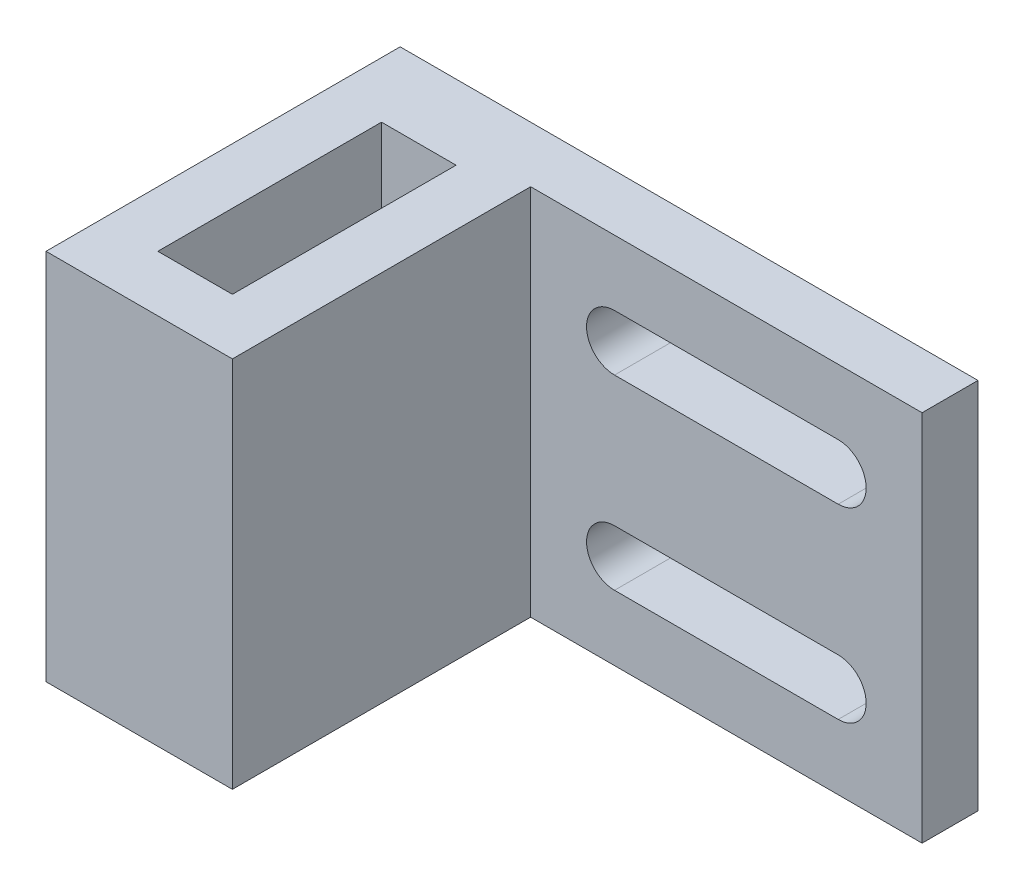
ISO-10303-21;
HEADER;
FILE_DESCRIPTION(('STEP AP214'),'2;1');
FILE_NAME('part.step','',(''),(''),'','','');
FILE_SCHEMA(('AUTOMOTIVE_DESIGN { 1 0 10303 214 1 1 1 1 }'));
ENDSEC;
DATA;
#1=APPLICATION_CONTEXT('core data for automotive mechanical design processes');
#2=APPLICATION_PROTOCOL_DEFINITION('international standard','automotive_design',2000,#1);
#3=PRODUCT_CONTEXT('',#1,'mechanical');
#4=PRODUCT('Part','Part','',(#3));
#5=PRODUCT_RELATED_PRODUCT_CATEGORY('part','',(#4));
#6=PRODUCT_DEFINITION_FORMATION('','',#4);
#7=PRODUCT_DEFINITION_CONTEXT('part definition',#1,'design');
#8=PRODUCT_DEFINITION('design','',#6,#7);
#9=PRODUCT_DEFINITION_SHAPE('','',#8);
#10=(LENGTH_UNIT() NAMED_UNIT(*) SI_UNIT(.MILLI.,.METRE.));
#11=(NAMED_UNIT(*) PLANE_ANGLE_UNIT() SI_UNIT($,.RADIAN.));
#12=(NAMED_UNIT(*) SI_UNIT($,.STERADIAN.) SOLID_ANGLE_UNIT());
#13=UNCERTAINTY_MEASURE_WITH_UNIT(LENGTH_MEASURE(1.E-05),#10,'distance_accuracy_value','');
#14=(GEOMETRIC_REPRESENTATION_CONTEXT(3) GLOBAL_UNCERTAINTY_ASSIGNED_CONTEXT((#13)) GLOBAL_UNIT_ASSIGNED_CONTEXT((#10,
#11,#12)) REPRESENTATION_CONTEXT('',''));
#15=CARTESIAN_POINT('',(0.,0.,0.));
#16=DIRECTION('',(0.,0.,1.));
#17=DIRECTION('',(1.,0.,0.));
#18=AXIS2_PLACEMENT_3D('',#15,#16,#17);
#19=CARTESIAN_POINT('',(2.,20.,-3.));
#20=DIRECTION('',(1.,0.,0.));
#21=DIRECTION('',(0.,0.,-1.));
#22=AXIS2_PLACEMENT_3D('',#19,#20,#21);
#23=PLANE('',#22);
#24=DIRECTION('',(0.,1.,0.));
#25=VECTOR('',#24,1.);
#26=CARTESIAN_POINT('',(2.,20.,-15.));
#27=LINE('',#26,#25);
#28=CARTESIAN_POINT('',(2.,0.,-15.));
#29=VERTEX_POINT('',#28);
#30=CARTESIAN_POINT('',(2.,20.,-15.));
#31=VERTEX_POINT('',#30);
#32=EDGE_CURVE('E170',#29,#31,#27,.T.);
#33=ORIENTED_EDGE('',*,*,#32,.F.);
#34=DIRECTION('',(0.,0.,1.));
#35=VECTOR('',#34,1.);
#36=CARTESIAN_POINT('',(2.,0.,-3.));
#37=LINE('',#36,#35);
#38=CARTESIAN_POINT('',(2.,0.,-3.));
#39=VERTEX_POINT('',#38);
#40=EDGE_CURVE('E160',#29,#39,#37,.T.);
#41=ORIENTED_EDGE('',*,*,#40,.T.);
#42=DIRECTION('',(0.,-1.,0.));
#43=VECTOR('',#42,1.);
#44=CARTESIAN_POINT('',(2.,20.,-3.));
#45=LINE('',#44,#43);
#46=CARTESIAN_POINT('',(2.,20.,-3.));
#47=VERTEX_POINT('',#46);
#48=EDGE_CURVE('E261',#47,#39,#45,.T.);
#49=ORIENTED_EDGE('',*,*,#48,.F.);
#50=DIRECTION('',(0.,0.,1.));
#51=VECTOR('',#50,1.);
#52=CARTESIAN_POINT('',(2.,20.,-3.));
#53=LINE('',#52,#51);
#54=EDGE_CURVE('E56',#31,#47,#53,.T.);
#55=ORIENTED_EDGE('',*,*,#54,.F.);
#56=EDGE_LOOP('',(#33,#41,#49,#55));
#57=FACE_BOUND('',#56,.T.);
#58=ADVANCED_FACE('F33',(#57),#23,.F.);
#59=CARTESIAN_POINT('',(-2.,20.,-19.));
#60=DIRECTION('',(-1.,0.,0.));
#61=DIRECTION('',(0.,0.,1.));
#62=AXIS2_PLACEMENT_3D('',#59,#60,#61);
#63=PLANE('',#62);
#64=DIRECTION('',(0.,-1.,0.));
#65=VECTOR('',#64,1.);
#66=CARTESIAN_POINT('',(-2.,20.,-15.));
#67=LINE('',#66,#65);
#68=CARTESIAN_POINT('',(-2.,20.,-15.));
#69=VERTEX_POINT('',#68);
#70=CARTESIAN_POINT('',(-2.,0.,-15.));
#71=VERTEX_POINT('',#70);
#72=EDGE_CURVE('E48',#69,#71,#67,.T.);
#73=ORIENTED_EDGE('',*,*,#72,.F.);
#74=DIRECTION('',(0.,0.,-1.));
#75=VECTOR('',#74,1.);
#76=CARTESIAN_POINT('',(-2.,20.,-19.));
#77=LINE('',#76,#75);
#78=CARTESIAN_POINT('',(-2.,20.,-3.));
#79=VERTEX_POINT('',#78);
#80=EDGE_CURVE('E239',#79,#69,#77,.T.);
#81=ORIENTED_EDGE('',*,*,#80,.F.);
#82=DIRECTION('',(0.,-1.,0.));
#83=VECTOR('',#82,1.);
#84=CARTESIAN_POINT('',(-2.,20.,-3.));
#85=LINE('',#84,#83);
#86=CARTESIAN_POINT('',(-2.,0.,-3.));
#87=VERTEX_POINT('',#86);
#88=EDGE_CURVE('E258',#79,#87,#85,.T.);
#89=ORIENTED_EDGE('',*,*,#88,.T.);
#90=DIRECTION('',(0.,0.,-1.));
#91=VECTOR('',#90,1.);
#92=CARTESIAN_POINT('',(-2.,0.,-19.));
#93=LINE('',#92,#91);
#94=EDGE_CURVE('E253',#87,#71,#93,.T.);
#95=ORIENTED_EDGE('',*,*,#94,.T.);
#96=EDGE_LOOP('',(#73,#81,#89,#95));
#97=FACE_BOUND('',#96,.T.);
#98=ADVANCED_FACE('F328',(#97),#63,.F.);
#99=CARTESIAN_POINT('',(-5.,20.,0.));
#100=DIRECTION('',(1.,0.,0.));
#101=DIRECTION('',(0.,0.,-1.));
#102=AXIS2_PLACEMENT_3D('',#99,#100,#101);
#103=PLANE('',#102);
#104=DIRECTION('',(0.,0.,1.));
#105=VECTOR('',#104,1.);
#106=CARTESIAN_POINT('',(-5.,0.,0.));
#107=LINE('',#106,#105);
#108=CARTESIAN_POINT('',(-5.,0.,-19.));
#109=VERTEX_POINT('',#108);
#110=CARTESIAN_POINT('',(-5.,0.,0.));
#111=VERTEX_POINT('',#110);
#112=EDGE_CURVE('E197',#109,#111,#107,.T.);
#113=ORIENTED_EDGE('',*,*,#112,.T.);
#114=DIRECTION('',(0.,-1.,0.));
#115=VECTOR('',#114,1.);
#116=CARTESIAN_POINT('',(-5.,20.,0.));
#117=LINE('',#116,#115);
#118=CARTESIAN_POINT('',(-5.,20.,0.));
#119=VERTEX_POINT('',#118);
#120=EDGE_CURVE('E275',#119,#111,#117,.T.);
#121=ORIENTED_EDGE('',*,*,#120,.F.);
#122=DIRECTION('',(0.,0.,1.));
#123=VECTOR('',#122,1.);
#124=CARTESIAN_POINT('',(-5.,20.,0.));
#125=LINE('',#124,#123);
#126=CARTESIAN_POINT('',(-5.,20.,-19.));
#127=VERTEX_POINT('',#126);
#128=EDGE_CURVE('E222',#127,#119,#125,.T.);
#129=ORIENTED_EDGE('',*,*,#128,.F.);
#130=DIRECTION('',(0.,-1.,0.));
#131=VECTOR('',#130,1.);
#132=CARTESIAN_POINT('',(-5.,20.,-19.));
#133=LINE('',#132,#131);
#134=EDGE_CURVE('E241',#127,#109,#133,.T.);
#135=ORIENTED_EDGE('',*,*,#134,.T.);
#136=EDGE_LOOP('',(#113,#121,#129,#135));
#137=FACE_BOUND('',#136,.T.);
#138=ADVANCED_FACE('F35',(#137),#103,.F.);
#139=CARTESIAN_POINT('',(5.,20.,0.));
#140=DIRECTION('',(0.,0.,-1.));
#141=DIRECTION('',(-1.,0.,0.));
#142=AXIS2_PLACEMENT_3D('',#139,#140,#141);
#143=PLANE('',#142);
#144=DIRECTION('',(1.,0.,0.));
#145=VECTOR('',#144,1.);
#146=CARTESIAN_POINT('',(5.,0.,0.));
#147=LINE('',#146,#145);
#148=CARTESIAN_POINT('',(5.,0.,0.));
#149=VERTEX_POINT('',#148);
#150=EDGE_CURVE('E244',#111,#149,#147,.T.);
#151=ORIENTED_EDGE('',*,*,#150,.T.);
#152=DIRECTION('',(0.,-1.,0.));
#153=VECTOR('',#152,1.);
#154=CARTESIAN_POINT('',(5.,20.,0.));
#155=LINE('',#154,#153);
#156=CARTESIAN_POINT('',(5.,20.,0.));
#157=VERTEX_POINT('',#156);
#158=EDGE_CURVE('E272',#157,#149,#155,.T.);
#159=ORIENTED_EDGE('',*,*,#158,.F.);
#160=DIRECTION('',(1.,0.,0.));
#161=VECTOR('',#160,1.);
#162=CARTESIAN_POINT('',(5.,20.,0.));
#163=LINE('',#162,#161);
#164=EDGE_CURVE('E225',#119,#157,#163,.T.);
#165=ORIENTED_EDGE('',*,*,#164,.F.);
#166=ORIENTED_EDGE('',*,*,#120,.T.);
#167=EDGE_LOOP('',(#151,#159,#165,#166));
#168=FACE_BOUND('',#167,.T.);
#169=ADVANCED_FACE('F345',(#168),#143,.F.);
#170=CARTESIAN_POINT('',(4.99999999999999,20.,-16.));
#171=DIRECTION('',(-1.,0.,0.));
#172=DIRECTION('',(0.,0.,1.));
#173=AXIS2_PLACEMENT_3D('',#170,#171,#172);
#174=PLANE('',#173);
#175=DIRECTION('',(0.,0.,-1.));
#176=VECTOR('',#175,1.);
#177=CARTESIAN_POINT('',(4.99999999999999,0.,-16.));
#178=LINE('',#177,#176);
#179=CARTESIAN_POINT('',(4.99999999999999,0.,-16.));
#180=VERTEX_POINT('',#179);
#181=EDGE_CURVE('E246',#149,#180,#178,.T.);
#182=ORIENTED_EDGE('',*,*,#181,.T.);
#183=DIRECTION('',(0.,-1.,0.));
#184=VECTOR('',#183,1.);
#185=CARTESIAN_POINT('',(4.99999999999999,20.,-16.));
#186=LINE('',#185,#184);
#187=CARTESIAN_POINT('',(4.99999999999999,20.,-16.));
#188=VERTEX_POINT('',#187);
#189=EDGE_CURVE('E269',#188,#180,#186,.T.);
#190=ORIENTED_EDGE('',*,*,#189,.F.);
#191=DIRECTION('',(0.,0.,-1.));
#192=VECTOR('',#191,1.);
#193=CARTESIAN_POINT('',(4.99999999999999,20.,-16.));
#194=LINE('',#193,#192);
#195=EDGE_CURVE('E228',#157,#188,#194,.T.);
#196=ORIENTED_EDGE('',*,*,#195,.F.);
#197=ORIENTED_EDGE('',*,*,#158,.T.);
#198=EDGE_LOOP('',(#182,#190,#196,#197));
#199=FACE_BOUND('',#198,.T.);
#200=ADVANCED_FACE('F343',(#199),#174,.F.);
#201=CARTESIAN_POINT('',(26.,20.,-16.));
#202=DIRECTION('',(0.,0.,-1.));
#203=DIRECTION('',(-1.,0.,0.));
#204=AXIS2_PLACEMENT_3D('',#201,#202,#203);
#205=PLANE('',#204);
#206=DIRECTION('',(-1.,0.,0.));
#207=VECTOR('',#206,1.);
#208=CARTESIAN_POINT('',(21.5,16.5,-16.));
#209=LINE('',#208,#207);
#210=CARTESIAN_POINT('',(21.5,16.5,-16.));
#211=VERTEX_POINT('',#210);
#212=CARTESIAN_POINT('',(9.5,16.5,-16.));
#213=VERTEX_POINT('',#212);
#214=EDGE_CURVE('E184',#211,#213,#209,.T.);
#215=ORIENTED_EDGE('',*,*,#214,.F.);
#216=CARTESIAN_POINT('',(21.5,15.,-16.));
#217=DIRECTION('',(0.,0.,1.));
#218=DIRECTION('',(1.,0.,0.));
#219=AXIS2_PLACEMENT_3D('',#216,#217,#218);
#220=CIRCLE('',#219,1.50000000000001);
#221=CARTESIAN_POINT('',(21.5,13.5,-16.));
#222=VERTEX_POINT('',#221);
#223=EDGE_CURVE('E182',#222,#211,#220,.T.);
#224=ORIENTED_EDGE('',*,*,#223,.F.);
#225=DIRECTION('',(1.,0.,0.));
#226=VECTOR('',#225,1.);
#227=CARTESIAN_POINT('',(21.5,13.5,-16.));
#228=LINE('',#227,#226);
#229=CARTESIAN_POINT('',(9.5,13.5,-16.));
#230=VERTEX_POINT('',#229);
#231=EDGE_CURVE('E191',#230,#222,#228,.T.);
#232=ORIENTED_EDGE('',*,*,#231,.F.);
#233=CARTESIAN_POINT('',(9.5,15.,-16.));
#234=DIRECTION('',(0.,0.,1.));
#235=DIRECTION('',(-1.,0.,0.));
#236=AXIS2_PLACEMENT_3D('',#233,#234,#235);
#237=CIRCLE('',#236,1.50000000000001);
#238=EDGE_CURVE('E188',#213,#230,#237,.T.);
#239=ORIENTED_EDGE('',*,*,#238,.F.);
#240=EDGE_LOOP('',(#215,#224,#232,#239));
#241=FACE_BOUND('',#240,.T.);
#242=DIRECTION('',(-1.,0.,0.));
#243=VECTOR('',#242,1.);
#244=CARTESIAN_POINT('',(21.5,6.50000000000001,-16.));
#245=LINE('',#244,#243);
#246=CARTESIAN_POINT('',(21.5,6.50000000000001,-16.));
#247=VERTEX_POINT('',#246);
#248=CARTESIAN_POINT('',(9.5,6.50000000000001,-16.));
#249=VERTEX_POINT('',#248);
#250=EDGE_CURVE('E205',#247,#249,#245,.T.);
#251=ORIENTED_EDGE('',*,*,#250,.F.);
#252=CARTESIAN_POINT('',(21.5,5.,-16.));
#253=DIRECTION('',(0.,0.,1.));
#254=DIRECTION('',(-1.,0.,0.));
#255=AXIS2_PLACEMENT_3D('',#252,#253,#254);
#256=CIRCLE('',#255,1.50000000000001);
#257=CARTESIAN_POINT('',(21.5,3.5,-16.));
#258=VERTEX_POINT('',#257);
#259=EDGE_CURVE('E174',#258,#247,#256,.T.);
#260=ORIENTED_EDGE('',*,*,#259,.F.);
#261=DIRECTION('',(1.,0.,0.));
#262=VECTOR('',#261,1.);
#263=CARTESIAN_POINT('',(21.5,3.5,-16.));
#264=LINE('',#263,#262);
#265=CARTESIAN_POINT('',(9.5,3.49999999999999,-16.));
#266=VERTEX_POINT('',#265);
#267=EDGE_CURVE('E211',#266,#258,#264,.T.);
#268=ORIENTED_EDGE('',*,*,#267,.F.);
#269=CARTESIAN_POINT('',(9.5,5.,-16.));
#270=DIRECTION('',(0.,0.,1.));
#271=DIRECTION('',(1.,0.,0.));
#272=AXIS2_PLACEMENT_3D('',#269,#270,#271);
#273=CIRCLE('',#272,1.50000000000001);
#274=EDGE_CURVE('E208',#249,#266,#273,.T.);
#275=ORIENTED_EDGE('',*,*,#274,.F.);
#276=EDGE_LOOP('',(#251,#260,#268,#275));
#277=FACE_BOUND('',#276,.T.);
#278=DIRECTION('',(1.,0.,0.));
#279=VECTOR('',#278,1.);
#280=CARTESIAN_POINT('',(26.,0.,-16.));
#281=LINE('',#280,#279);
#282=CARTESIAN_POINT('',(26.,0.,-16.));
#283=VERTEX_POINT('',#282);
#284=EDGE_CURVE('E248',#180,#283,#281,.T.);
#285=ORIENTED_EDGE('',*,*,#284,.T.);
#286=DIRECTION('',(0.,-1.,0.));
#287=VECTOR('',#286,1.);
#288=CARTESIAN_POINT('',(26.,20.,-16.));
#289=LINE('',#288,#287);
#290=CARTESIAN_POINT('',(26.,20.,-16.));
#291=VERTEX_POINT('',#290);
#292=EDGE_CURVE('E266',#291,#283,#289,.T.);
#293=ORIENTED_EDGE('',*,*,#292,.F.);
#294=DIRECTION('',(1.,0.,0.));
#295=VECTOR('',#294,1.);
#296=CARTESIAN_POINT('',(26.,20.,-16.));
#297=LINE('',#296,#295);
#298=EDGE_CURVE('E230',#188,#291,#297,.T.);
#299=ORIENTED_EDGE('',*,*,#298,.F.);
#300=ORIENTED_EDGE('',*,*,#189,.T.);
#301=EDGE_LOOP('',(#285,#293,#299,#300));
#302=FACE_BOUND('',#301,.T.);
#303=ADVANCED_FACE('F311',(#241,#277,#302),#205,.F.);
#304=CARTESIAN_POINT('',(26.,20.,-19.));
#305=DIRECTION('',(-1.,0.,0.));
#306=DIRECTION('',(0.,0.,1.));
#307=AXIS2_PLACEMENT_3D('',#304,#305,#306);
#308=PLANE('',#307);
#309=DIRECTION('',(0.,0.,-1.));
#310=VECTOR('',#309,1.);
#311=CARTESIAN_POINT('',(26.,0.,-19.));
#312=LINE('',#311,#310);
#313=CARTESIAN_POINT('',(26.,0.,-19.));
#314=VERTEX_POINT('',#313);
#315=EDGE_CURVE('E168',#283,#314,#312,.T.);
#316=ORIENTED_EDGE('',*,*,#315,.T.);
#317=DIRECTION('',(0.,-1.,0.));
#318=VECTOR('',#317,1.);
#319=CARTESIAN_POINT('',(26.,20.,-19.));
#320=LINE('',#319,#318);
#321=CARTESIAN_POINT('',(26.,20.,-19.));
#322=VERTEX_POINT('',#321);
#323=EDGE_CURVE('E263',#322,#314,#320,.T.);
#324=ORIENTED_EDGE('',*,*,#323,.F.);
#325=DIRECTION('',(0.,0.,-1.));
#326=VECTOR('',#325,1.);
#327=CARTESIAN_POINT('',(26.,20.,-19.));
#328=LINE('',#327,#326);
#329=EDGE_CURVE('E232',#291,#322,#328,.T.);
#330=ORIENTED_EDGE('',*,*,#329,.F.);
#331=ORIENTED_EDGE('',*,*,#292,.T.);
#332=EDGE_LOOP('',(#316,#324,#330,#331));
#333=FACE_BOUND('',#332,.T.);
#334=ADVANCED_FACE('F337',(#333),#308,.F.);
#335=CARTESIAN_POINT('',(-2.,20.,-3.));
#336=DIRECTION('',(0.,0.,1.));
#337=DIRECTION('',(1.,0.,0.));
#338=AXIS2_PLACEMENT_3D('',#335,#336,#337);
#339=PLANE('',#338);
#340=DIRECTION('',(-1.,0.,0.));
#341=VECTOR('',#340,1.);
#342=CARTESIAN_POINT('',(-2.,0.,-3.));
#343=LINE('',#342,#341);
#344=EDGE_CURVE('E166',#39,#87,#343,.T.);
#345=ORIENTED_EDGE('',*,*,#344,.T.);
#346=ORIENTED_EDGE('',*,*,#88,.F.);
#347=DIRECTION('',(-1.,0.,0.));
#348=VECTOR('',#347,1.);
#349=CARTESIAN_POINT('',(-2.,20.,-3.));
#350=LINE('',#349,#348);
#351=EDGE_CURVE('E237',#47,#79,#350,.T.);
#352=ORIENTED_EDGE('',*,*,#351,.F.);
#353=ORIENTED_EDGE('',*,*,#48,.T.);
#354=EDGE_LOOP('',(#345,#346,#352,#353));
#355=FACE_BOUND('',#354,.T.);
#356=ADVANCED_FACE('F336',(#355),#339,.F.);
#357=CARTESIAN_POINT('',(-5.,20.,-19.));
#358=DIRECTION('',(0.,0.,1.));
#359=DIRECTION('',(1.,0.,0.));
#360=AXIS2_PLACEMENT_3D('',#357,#358,#359);
#361=PLANE('',#360);
#362=DIRECTION('',(-1.,0.,0.));
#363=VECTOR('',#362,1.);
#364=CARTESIAN_POINT('',(-5.,0.,-19.));
#365=LINE('',#364,#363);
#366=EDGE_CURVE('E226',#314,#109,#365,.T.);
#367=ORIENTED_EDGE('',*,*,#366,.T.);
#368=ORIENTED_EDGE('',*,*,#134,.F.);
#369=DIRECTION('',(-1.,0.,0.));
#370=VECTOR('',#369,1.);
#371=CARTESIAN_POINT('',(2.,20.,-19.));
#372=LINE('',#371,#370);
#373=EDGE_CURVE('E234',#322,#127,#372,.T.);
#374=ORIENTED_EDGE('',*,*,#373,.F.);
#375=ORIENTED_EDGE('',*,*,#323,.T.);
#376=EDGE_LOOP('',(#367,#368,#374,#375));
#377=FACE_BOUND('',#376,.T.);
#378=DIRECTION('',(1.,0.,0.));
#379=VECTOR('',#378,1.);
#380=CARTESIAN_POINT('',(2.,13.5,-19.));
#381=LINE('',#380,#379);
#382=CARTESIAN_POINT('',(9.5,13.5,-19.));
#383=VERTEX_POINT('',#382);
#384=CARTESIAN_POINT('',(21.5,13.5,-19.));
#385=VERTEX_POINT('',#384);
#386=EDGE_CURVE('E41',#383,#385,#381,.T.);
#387=ORIENTED_EDGE('',*,*,#386,.T.);
#388=CARTESIAN_POINT('',(21.5,15.,-19.));
#389=DIRECTION('',(0.,0.,1.));
#390=DIRECTION('',(1.,0.,0.));
#391=AXIS2_PLACEMENT_3D('',#388,#389,#390);
#392=CIRCLE('',#391,1.50000000000001);
#393=CARTESIAN_POINT('',(21.5,16.5,-19.));
#394=VERTEX_POINT('',#393);
#395=EDGE_CURVE('E11',#385,#394,#392,.T.);
#396=ORIENTED_EDGE('',*,*,#395,.T.);
#397=DIRECTION('',(-1.,0.,0.));
#398=VECTOR('',#397,1.);
#399=CARTESIAN_POINT('',(2.,16.5,-19.));
#400=LINE('',#399,#398);
#401=CARTESIAN_POINT('',(9.5,16.5,-19.));
#402=VERTEX_POINT('',#401);
#403=EDGE_CURVE('E290',#394,#402,#400,.T.);
#404=ORIENTED_EDGE('',*,*,#403,.T.);
#405=CARTESIAN_POINT('',(9.5,15.,-19.));
#406=DIRECTION('',(0.,0.,1.));
#407=DIRECTION('',(1.,0.,0.));
#408=AXIS2_PLACEMENT_3D('',#405,#406,#407);
#409=CIRCLE('',#408,1.50000000000001);
#410=EDGE_CURVE('E293',#402,#383,#409,.T.);
#411=ORIENTED_EDGE('',*,*,#410,.T.);
#412=EDGE_LOOP('',(#387,#396,#404,#411));
#413=FACE_BOUND('',#412,.T.);
#414=DIRECTION('',(1.,0.,0.));
#415=VECTOR('',#414,1.);
#416=CARTESIAN_POINT('',(2.,3.49999999999999,-19.));
#417=LINE('',#416,#415);
#418=CARTESIAN_POINT('',(9.5,3.49999999999999,-19.));
#419=VERTEX_POINT('',#418);
#420=CARTESIAN_POINT('',(21.5,3.5,-19.));
#421=VERTEX_POINT('',#420);
#422=EDGE_CURVE('E284',#419,#421,#417,.T.);
#423=ORIENTED_EDGE('',*,*,#422,.T.);
#424=CARTESIAN_POINT('',(21.5,5.,-19.));
#425=DIRECTION('',(0.,0.,1.));
#426=DIRECTION('',(1.,0.,0.));
#427=AXIS2_PLACEMENT_3D('',#424,#425,#426);
#428=CIRCLE('',#427,1.50000000000001);
#429=CARTESIAN_POINT('',(21.5,6.50000000000001,-19.));
#430=VERTEX_POINT('',#429);
#431=EDGE_CURVE('E287',#421,#430,#428,.T.);
#432=ORIENTED_EDGE('',*,*,#431,.T.);
#433=DIRECTION('',(-1.,0.,0.));
#434=VECTOR('',#433,1.);
#435=CARTESIAN_POINT('',(2.,6.50000000000001,-19.));
#436=LINE('',#435,#434);
#437=CARTESIAN_POINT('',(9.5,6.50000000000001,-19.));
#438=VERTEX_POINT('',#437);
#439=EDGE_CURVE('E278',#430,#438,#436,.T.);
#440=ORIENTED_EDGE('',*,*,#439,.T.);
#441=CARTESIAN_POINT('',(9.5,5.,-19.));
#442=DIRECTION('',(0.,0.,1.));
#443=DIRECTION('',(1.,0.,0.));
#444=AXIS2_PLACEMENT_3D('',#441,#442,#443);
#445=CIRCLE('',#444,1.50000000000001);
#446=EDGE_CURVE('E281',#438,#419,#445,.T.);
#447=ORIENTED_EDGE('',*,*,#446,.T.);
#448=EDGE_LOOP('',(#423,#432,#440,#447));
#449=FACE_BOUND('',#448,.T.);
#450=ADVANCED_FACE('F297',(#377,#413,#449),#361,.F.);
#451=CARTESIAN_POINT('',(0.,20.,0.));
#452=DIRECTION('',(0.,-1.,0.));
#453=DIRECTION('',(0.,0.,-1.));
#454=AXIS2_PLACEMENT_3D('',#451,#452,#453);
#455=PLANE('',#454);
#456=DIRECTION('',(-1.,0.,0.));
#457=VECTOR('',#456,1.);
#458=CARTESIAN_POINT('',(3.,20.,-15.));
#459=LINE('',#458,#457);
#460=EDGE_CURVE('E175',#31,#69,#459,.T.);
#461=ORIENTED_EDGE('',*,*,#460,.F.);
#462=ORIENTED_EDGE('',*,*,#54,.T.);
#463=ORIENTED_EDGE('',*,*,#351,.T.);
#464=ORIENTED_EDGE('',*,*,#80,.T.);
#465=EDGE_LOOP('',(#461,#462,#463,#464));
#466=FACE_BOUND('',#465,.T.);
#467=ORIENTED_EDGE('',*,*,#373,.T.);
#468=ORIENTED_EDGE('',*,*,#128,.T.);
#469=ORIENTED_EDGE('',*,*,#164,.T.);
#470=ORIENTED_EDGE('',*,*,#195,.T.);
#471=ORIENTED_EDGE('',*,*,#298,.T.);
#472=ORIENTED_EDGE('',*,*,#329,.T.);
#473=EDGE_LOOP('',(#467,#468,#469,#470,#471,#472));
#474=FACE_BOUND('',#473,.T.);
#475=ADVANCED_FACE('F368',(#466,#474),#455,.F.);
#476=CARTESIAN_POINT('',(0.,0.,0.));
#477=DIRECTION('',(0.,-1.,0.));
#478=DIRECTION('',(0.,0.,-1.));
#479=AXIS2_PLACEMENT_3D('',#476,#477,#478);
#480=PLANE('',#479);
#481=ORIENTED_EDGE('',*,*,#40,.F.);
#482=DIRECTION('',(-1.,0.,0.));
#483=VECTOR('',#482,1.);
#484=CARTESIAN_POINT('',(3.,0.,-15.));
#485=LINE('',#484,#483);
#486=EDGE_CURVE('E165',#29,#71,#485,.T.);
#487=ORIENTED_EDGE('',*,*,#486,.T.);
#488=ORIENTED_EDGE('',*,*,#94,.F.);
#489=ORIENTED_EDGE('',*,*,#344,.F.);
#490=EDGE_LOOP('',(#481,#487,#488,#489));
#491=FACE_BOUND('',#490,.T.);
#492=ORIENTED_EDGE('',*,*,#366,.F.);
#493=ORIENTED_EDGE('',*,*,#315,.F.);
#494=ORIENTED_EDGE('',*,*,#284,.F.);
#495=ORIENTED_EDGE('',*,*,#181,.F.);
#496=ORIENTED_EDGE('',*,*,#150,.F.);
#497=ORIENTED_EDGE('',*,*,#112,.F.);
#498=EDGE_LOOP('',(#492,#493,#494,#495,#496,#497));
#499=FACE_BOUND('',#498,.T.);
#500=ADVANCED_FACE('F161',(#491,#499),#480,.T.);
#501=CARTESIAN_POINT('',(21.5,5.,-36.));
#502=DIRECTION('',(0.,0.,1.));
#503=DIRECTION('',(1.,0.,0.));
#504=AXIS2_PLACEMENT_3D('',#501,#502,#503);
#505=CYLINDRICAL_SURFACE('',#504,1.50000000000001);
#506=DIRECTION('',(0.,0.,1.));
#507=VECTOR('',#506,1.);
#508=CARTESIAN_POINT('',(21.5,3.5,-36.));
#509=LINE('',#508,#507);
#510=EDGE_CURVE('E185',#421,#258,#509,.T.);
#511=ORIENTED_EDGE('',*,*,#510,.T.);
#512=ORIENTED_EDGE('',*,*,#259,.T.);
#513=DIRECTION('',(0.,0.,1.));
#514=VECTOR('',#513,1.);
#515=CARTESIAN_POINT('',(21.5,6.50000000000001,-36.));
#516=LINE('',#515,#514);
#517=EDGE_CURVE('E214',#430,#247,#516,.T.);
#518=ORIENTED_EDGE('',*,*,#517,.F.);
#519=ORIENTED_EDGE('',*,*,#431,.F.);
#520=EDGE_LOOP('',(#511,#512,#518,#519));
#521=FACE_BOUND('',#520,.T.);
#522=ADVANCED_FACE('F383',(#521),#505,.F.);
#523=CARTESIAN_POINT('',(21.5,3.5,-36.));
#524=DIRECTION('',(0.,-1.,0.));
#525=DIRECTION('',(1.,0.,0.));
#526=AXIS2_PLACEMENT_3D('',#523,#524,#525);
#527=PLANE('',#526);
#528=DIRECTION('',(0.,0.,1.));
#529=VECTOR('',#528,1.);
#530=CARTESIAN_POINT('',(9.5,3.49999999999999,-36.));
#531=LINE('',#530,#529);
#532=EDGE_CURVE('E216',#419,#266,#531,.T.);
#533=ORIENTED_EDGE('',*,*,#532,.T.);
#534=ORIENTED_EDGE('',*,*,#267,.T.);
#535=ORIENTED_EDGE('',*,*,#510,.F.);
#536=ORIENTED_EDGE('',*,*,#422,.F.);
#537=EDGE_LOOP('',(#533,#534,#535,#536));
#538=FACE_BOUND('',#537,.T.);
#539=ADVANCED_FACE('F387',(#538),#527,.F.);
#540=CARTESIAN_POINT('',(9.5,5.,-36.));
#541=DIRECTION('',(0.,0.,1.));
#542=DIRECTION('',(1.,0.,0.));
#543=AXIS2_PLACEMENT_3D('',#540,#541,#542);
#544=CYLINDRICAL_SURFACE('',#543,1.50000000000001);
#545=DIRECTION('',(0.,0.,1.));
#546=VECTOR('',#545,1.);
#547=CARTESIAN_POINT('',(9.5,6.50000000000001,-36.));
#548=LINE('',#547,#546);
#549=EDGE_CURVE('E218',#438,#249,#548,.T.);
#550=ORIENTED_EDGE('',*,*,#549,.T.);
#551=ORIENTED_EDGE('',*,*,#274,.T.);
#552=ORIENTED_EDGE('',*,*,#532,.F.);
#553=ORIENTED_EDGE('',*,*,#446,.F.);
#554=EDGE_LOOP('',(#550,#551,#552,#553));
#555=FACE_BOUND('',#554,.T.);
#556=ADVANCED_FACE('F392',(#555),#544,.F.);
#557=CARTESIAN_POINT('',(21.5,6.50000000000001,-36.));
#558=DIRECTION('',(0.,1.,0.));
#559=DIRECTION('',(-1.,0.,0.));
#560=AXIS2_PLACEMENT_3D('',#557,#558,#559);
#561=PLANE('',#560);
#562=ORIENTED_EDGE('',*,*,#517,.T.);
#563=ORIENTED_EDGE('',*,*,#250,.T.);
#564=ORIENTED_EDGE('',*,*,#549,.F.);
#565=ORIENTED_EDGE('',*,*,#439,.F.);
#566=EDGE_LOOP('',(#562,#563,#564,#565));
#567=FACE_BOUND('',#566,.T.);
#568=ADVANCED_FACE('F389',(#567),#561,.F.);
#569=CARTESIAN_POINT('',(21.5,15.,-36.));
#570=DIRECTION('',(0.,0.,1.));
#571=DIRECTION('',(1.,0.,0.));
#572=AXIS2_PLACEMENT_3D('',#569,#570,#571);
#573=CYLINDRICAL_SURFACE('',#572,1.50000000000001);
#574=DIRECTION('',(0.,0.,1.));
#575=VECTOR('',#574,1.);
#576=CARTESIAN_POINT('',(21.5,13.5,-36.));
#577=LINE('',#576,#575);
#578=EDGE_CURVE('E195',#385,#222,#577,.T.);
#579=ORIENTED_EDGE('',*,*,#578,.T.);
#580=ORIENTED_EDGE('',*,*,#223,.T.);
#581=DIRECTION('',(0.,0.,1.));
#582=VECTOR('',#581,1.);
#583=CARTESIAN_POINT('',(21.5,16.5,-36.));
#584=LINE('',#583,#582);
#585=EDGE_CURVE('E194',#394,#211,#584,.T.);
#586=ORIENTED_EDGE('',*,*,#585,.F.);
#587=ORIENTED_EDGE('',*,*,#395,.F.);
#588=EDGE_LOOP('',(#579,#580,#586,#587));
#589=FACE_BOUND('',#588,.T.);
#590=ADVANCED_FACE('F315',(#589),#573,.F.);
#591=CARTESIAN_POINT('',(21.5,13.5,-36.));
#592=DIRECTION('',(0.,-1.,0.));
#593=DIRECTION('',(1.,0.,0.));
#594=AXIS2_PLACEMENT_3D('',#591,#592,#593);
#595=PLANE('',#594);
#596=DIRECTION('',(0.,0.,1.));
#597=VECTOR('',#596,1.);
#598=CARTESIAN_POINT('',(9.5,13.5,-36.));
#599=LINE('',#598,#597);
#600=EDGE_CURVE('E198',#383,#230,#599,.T.);
#601=ORIENTED_EDGE('',*,*,#600,.T.);
#602=ORIENTED_EDGE('',*,*,#231,.T.);
#603=ORIENTED_EDGE('',*,*,#578,.F.);
#604=ORIENTED_EDGE('',*,*,#386,.F.);
#605=EDGE_LOOP('',(#601,#602,#603,#604));
#606=FACE_BOUND('',#605,.T.);
#607=ADVANCED_FACE('F303',(#606),#595,.F.);
#608=CARTESIAN_POINT('',(9.5,15.,-36.));
#609=DIRECTION('',(0.,0.,1.));
#610=DIRECTION('',(1.,0.,0.));
#611=AXIS2_PLACEMENT_3D('',#608,#609,#610);
#612=CYLINDRICAL_SURFACE('',#611,1.50000000000001);
#613=DIRECTION('',(0.,0.,1.));
#614=VECTOR('',#613,1.);
#615=CARTESIAN_POINT('',(9.5,16.5,-36.));
#616=LINE('',#615,#614);
#617=EDGE_CURVE('E200',#402,#213,#616,.T.);
#618=ORIENTED_EDGE('',*,*,#617,.T.);
#619=ORIENTED_EDGE('',*,*,#238,.T.);
#620=ORIENTED_EDGE('',*,*,#600,.F.);
#621=ORIENTED_EDGE('',*,*,#410,.F.);
#622=EDGE_LOOP('',(#618,#619,#620,#621));
#623=FACE_BOUND('',#622,.T.);
#624=ADVANCED_FACE('F305',(#623),#612,.F.);
#625=CARTESIAN_POINT('',(21.5,16.5,-36.));
#626=DIRECTION('',(0.,1.,0.));
#627=DIRECTION('',(0.,0.,1.));
#628=AXIS2_PLACEMENT_3D('',#625,#626,#627);
#629=PLANE('',#628);
#630=ORIENTED_EDGE('',*,*,#585,.T.);
#631=ORIENTED_EDGE('',*,*,#214,.T.);
#632=ORIENTED_EDGE('',*,*,#617,.F.);
#633=ORIENTED_EDGE('',*,*,#403,.F.);
#634=EDGE_LOOP('',(#630,#631,#632,#633));
#635=FACE_BOUND('',#634,.T.);
#636=ADVANCED_FACE('F317',(#635),#629,.F.);
#637=CARTESIAN_POINT('',(3.,20.,-15.));
#638=DIRECTION('',(0.,0.,-1.));
#639=DIRECTION('',(-1.,0.,0.));
#640=AXIS2_PLACEMENT_3D('',#637,#638,#639);
#641=PLANE('',#640);
#642=ORIENTED_EDGE('',*,*,#486,.F.);
#643=ORIENTED_EDGE('',*,*,#32,.T.);
#644=ORIENTED_EDGE('',*,*,#460,.T.);
#645=ORIENTED_EDGE('',*,*,#72,.T.);
#646=EDGE_LOOP('',(#642,#643,#644,#645));
#647=FACE_BOUND('',#646,.T.);
#648=ADVANCED_FACE('F177',(#647),#641,.F.);
#649=CLOSED_SHELL('',(#58,#98,#138,#169,#200,#303,#334,#356,#450,#475,#500,#522,#539,#556,#568,
#590,#607,#624,#636,#648));
#650=MANIFOLD_SOLID_BREP('B2',#649);
#651=ADVANCED_BREP_SHAPE_REPRESENTATION('',(#18,#650),#14);
#652=SHAPE_DEFINITION_REPRESENTATION(#9,#651);
ENDSEC;
END-ISO-10303-21;
